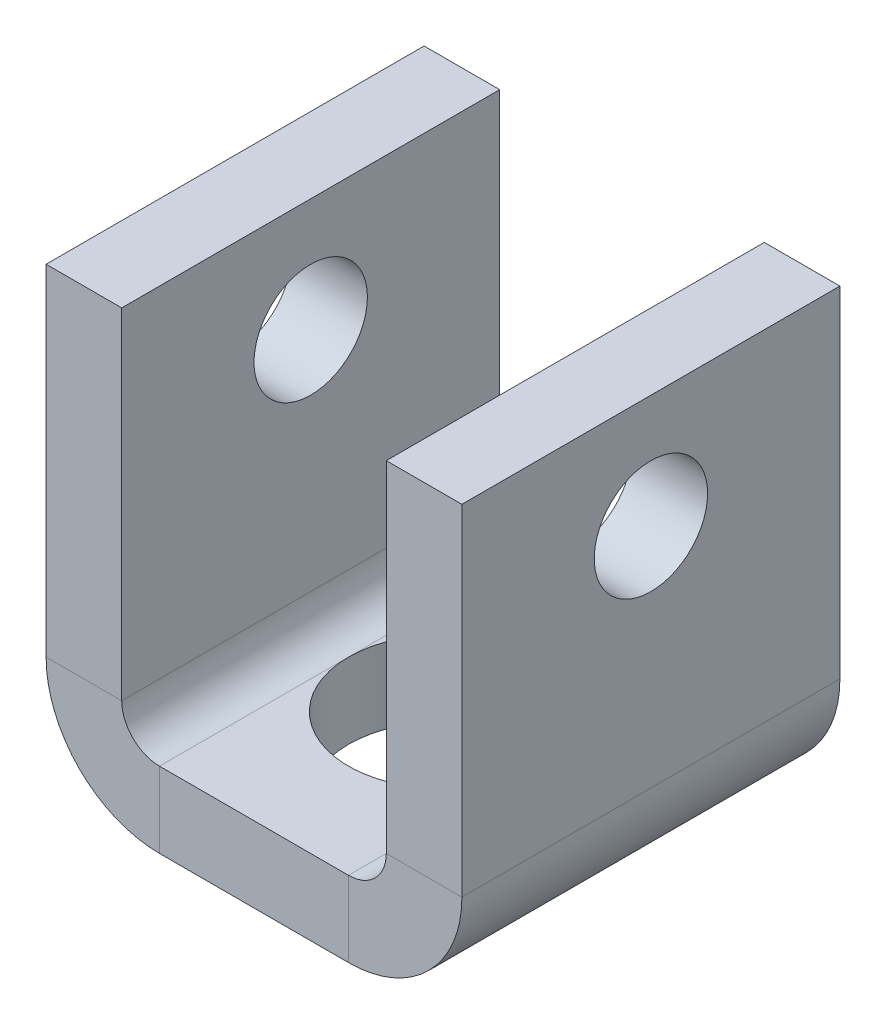
ISO-10303-21;
HEADER;
FILE_DESCRIPTION(('STEP AP214'),'2;1');
FILE_NAME('part.step','',(''),(''),'','','');
FILE_SCHEMA(('AUTOMOTIVE_DESIGN { 1 0 10303 214 1 1 1 1 }'));
ENDSEC;
DATA;
#1=APPLICATION_CONTEXT('core data for automotive mechanical design processes');
#2=APPLICATION_PROTOCOL_DEFINITION('international standard','automotive_design',2000,#1);
#3=PRODUCT_CONTEXT('',#1,'mechanical');
#4=PRODUCT('Part','Part','',(#3));
#5=PRODUCT_RELATED_PRODUCT_CATEGORY('part','',(#4));
#6=PRODUCT_DEFINITION_FORMATION('','',#4);
#7=PRODUCT_DEFINITION_CONTEXT('part definition',#1,'design');
#8=PRODUCT_DEFINITION('design','',#6,#7);
#9=PRODUCT_DEFINITION_SHAPE('','',#8);
#10=(LENGTH_UNIT() NAMED_UNIT(*) SI_UNIT(.MILLI.,.METRE.));
#11=(NAMED_UNIT(*) PLANE_ANGLE_UNIT() SI_UNIT($,.RADIAN.));
#12=(NAMED_UNIT(*) SI_UNIT($,.STERADIAN.) SOLID_ANGLE_UNIT());
#13=UNCERTAINTY_MEASURE_WITH_UNIT(LENGTH_MEASURE(1.E-05),#10,'distance_accuracy_value','');
#14=(GEOMETRIC_REPRESENTATION_CONTEXT(3) GLOBAL_UNCERTAINTY_ASSIGNED_CONTEXT((#13)) GLOBAL_UNIT_ASSIGNED_CONTEXT((#10,
#11,#12)) REPRESENTATION_CONTEXT('',''));
#15=CARTESIAN_POINT('',(0.,0.,0.));
#16=DIRECTION('',(0.,0.,1.));
#17=DIRECTION('',(1.,0.,0.));
#18=AXIS2_PLACEMENT_3D('',#15,#16,#17);
#19=CARTESIAN_POINT('',(-45.2821772639692,22.8679913294798,10.));
#20=DIRECTION('',(0.,1.,0.));
#21=DIRECTION('',(0.,0.,1.));
#22=AXIS2_PLACEMENT_3D('',#19,#20,#21);
#23=PLANE('',#22);
#24=DIRECTION('',(0.,0.,1.));
#25=VECTOR('',#24,1.);
#26=CARTESIAN_POINT('',(-42.2821772639692,22.8679913294798,0.));
#27=LINE('',#26,#25);
#28=CARTESIAN_POINT('',(-42.2821772639692,22.8679913294798,0.));
#29=VERTEX_POINT('',#28);
#30=CARTESIAN_POINT('',(-42.2821772639692,22.8679913294798,5.));
#31=VERTEX_POINT('',#30);
#32=EDGE_CURVE('E153',#29,#31,#27,.T.);
#33=ORIENTED_EDGE('',*,*,#32,.T.);
#34=CARTESIAN_POINT('',(-39.7821772639692,22.8679913294798,5.));
#35=DIRECTION('',(0.,1.,0.));
#36=DIRECTION('',(0.,0.,1.));
#37=AXIS2_PLACEMENT_3D('',#34,#35,#36);
#38=CIRCLE('',#37,2.5);
#39=CARTESIAN_POINT('',(-37.2821772639692,22.8679913294798,5.));
#40=VERTEX_POINT('',#39);
#41=EDGE_CURVE('E62',#31,#40,#38,.F.);
#42=ORIENTED_EDGE('',*,*,#41,.T.);
#43=DIRECTION('',(0.,0.,-1.));
#44=VECTOR('',#43,1.);
#45=CARTESIAN_POINT('',(-37.2821772639692,22.8679913294798,10.));
#46=LINE('',#45,#44);
#47=CARTESIAN_POINT('',(-37.2821772639692,22.8679913294798,0.));
#48=VERTEX_POINT('',#47);
#49=EDGE_CURVE('E150',#40,#48,#46,.T.);
#50=ORIENTED_EDGE('',*,*,#49,.T.);
#51=DIRECTION('',(1.,0.,0.));
#52=VECTOR('',#51,1.);
#53=CARTESIAN_POINT('',(-45.2821772639692,22.8679913294798,0.));
#54=LINE('',#53,#52);
#55=EDGE_CURVE('E305',#29,#48,#54,.T.);
#56=ORIENTED_EDGE('',*,*,#55,.F.);
#57=EDGE_LOOP('',(#33,#42,#50,#56));
#58=FACE_BOUND('',#57,.T.);
#59=ADVANCED_FACE('F39',(#58),#23,.T.);
#60=CARTESIAN_POINT('',(-37.2821772639692,22.8679913294798,10.));
#61=VERTEX_POINT('',#60);
#62=EDGE_CURVE('E162',#61,#40,#46,.T.);
#63=ORIENTED_EDGE('',*,*,#62,.T.);
#64=CARTESIAN_POINT('',(-39.7821772639692,22.8679913294798,5.));
#65=DIRECTION('',(0.,1.,0.));
#66=DIRECTION('',(0.,0.,1.));
#67=AXIS2_PLACEMENT_3D('',#64,#65,#66);
#68=CIRCLE('',#67,2.5);
#69=EDGE_CURVE('E139',#40,#31,#68,.F.);
#70=ORIENTED_EDGE('',*,*,#69,.T.);
#71=CARTESIAN_POINT('',(-42.2821772639692,22.8679913294798,10.));
#72=VERTEX_POINT('',#71);
#73=EDGE_CURVE('E308',#31,#72,#27,.T.);
#74=ORIENTED_EDGE('',*,*,#73,.T.);
#75=DIRECTION('',(1.,0.,0.));
#76=VECTOR('',#75,1.);
#77=CARTESIAN_POINT('',(-45.2821772639692,22.8679913294798,10.));
#78=LINE('',#77,#76);
#79=EDGE_CURVE('E172',#72,#61,#78,.T.);
#80=ORIENTED_EDGE('',*,*,#79,.T.);
#81=EDGE_LOOP('',(#63,#70,#74,#80));
#82=FACE_BOUND('',#81,.T.);
#83=ADVANCED_FACE('F170',(#82),#23,.T.);
#84=CARTESIAN_POINT('',(-45.2821772639692,20.8679913294798,10.));
#85=DIRECTION('',(0.,1.,0.));
#86=DIRECTION('',(0.,0.,1.));
#87=AXIS2_PLACEMENT_3D('',#84,#85,#86);
#88=PLANE('',#87);
#89=CARTESIAN_POINT('',(-39.7821772639692,20.8679913294798,5.));
#90=DIRECTION('',(0.,1.,0.));
#91=DIRECTION('',(0.,0.,1.));
#92=AXIS2_PLACEMENT_3D('',#89,#90,#91);
#93=CIRCLE('',#92,2.5);
#94=CARTESIAN_POINT('',(-42.2821772639692,20.8679913294798,5.));
#95=VERTEX_POINT('',#94);
#96=CARTESIAN_POINT('',(-37.2821772639692,20.8679913294798,5.));
#97=VERTEX_POINT('',#96);
#98=EDGE_CURVE('E55',#95,#97,#93,.F.);
#99=ORIENTED_EDGE('',*,*,#98,.F.);
#100=DIRECTION('',(0.,0.,1.));
#101=VECTOR('',#100,1.);
#102=CARTESIAN_POINT('',(-42.2821772639692,20.8679913294798,0.));
#103=LINE('',#102,#101);
#104=CARTESIAN_POINT('',(-42.2821772639692,20.8679913294798,0.));
#105=VERTEX_POINT('',#104);
#106=EDGE_CURVE('E303',#105,#95,#103,.T.);
#107=ORIENTED_EDGE('',*,*,#106,.F.);
#108=DIRECTION('',(1.,0.,0.));
#109=VECTOR('',#108,1.);
#110=CARTESIAN_POINT('',(-45.2821772639692,20.8679913294798,0.));
#111=LINE('',#110,#109);
#112=CARTESIAN_POINT('',(-37.2821772639692,20.8679913294798,0.));
#113=VERTEX_POINT('',#112);
#114=EDGE_CURVE('E293',#105,#113,#111,.T.);
#115=ORIENTED_EDGE('',*,*,#114,.T.);
#116=DIRECTION('',(0.,0.,-1.));
#117=VECTOR('',#116,1.);
#118=CARTESIAN_POINT('',(-37.2821772639692,20.8679913294798,10.));
#119=LINE('',#118,#117);
#120=EDGE_CURVE('E173',#97,#113,#119,.T.);
#121=ORIENTED_EDGE('',*,*,#120,.F.);
#122=EDGE_LOOP('',(#99,#107,#115,#121));
#123=FACE_BOUND('',#122,.T.);
#124=ADVANCED_FACE('F328',(#123),#88,.F.);
#125=EDGE_CURVE('E155',#97,#95,#93,.F.);
#126=ORIENTED_EDGE('',*,*,#125,.F.);
#127=CARTESIAN_POINT('',(-37.2821772639692,20.8679913294798,10.));
#128=VERTEX_POINT('',#127);
#129=EDGE_CURVE('E174',#128,#97,#119,.T.);
#130=ORIENTED_EDGE('',*,*,#129,.F.);
#131=DIRECTION('',(1.,0.,0.));
#132=VECTOR('',#131,1.);
#133=CARTESIAN_POINT('',(-45.2821772639692,20.8679913294798,10.));
#134=LINE('',#133,#132);
#135=CARTESIAN_POINT('',(-42.2821772639692,20.8679913294798,10.));
#136=VERTEX_POINT('',#135);
#137=EDGE_CURVE('E298',#136,#128,#134,.T.);
#138=ORIENTED_EDGE('',*,*,#137,.F.);
#139=EDGE_CURVE('E302',#95,#136,#103,.T.);
#140=ORIENTED_EDGE('',*,*,#139,.F.);
#141=EDGE_LOOP('',(#126,#130,#138,#140));
#142=FACE_BOUND('',#141,.T.);
#143=ADVANCED_FACE('F324',(#142),#88,.F.);
#144=CARTESIAN_POINT('',(-16.3749291698218,32.8679913294798,10.));
#145=DIRECTION('',(0.,1.,0.));
#146=DIRECTION('',(-1.,0.,0.));
#147=AXIS2_PLACEMENT_3D('',#144,#145,#146);
#148=PLANE('',#147);
#149=DIRECTION('',(0.,0.,-1.));
#150=VECTOR('',#149,1.);
#151=CARTESIAN_POINT('',(-45.2821772639692,32.8679913294798,10.));
#152=LINE('',#151,#150);
#153=CARTESIAN_POINT('',(-45.2821772639692,32.8679913294798,10.));
#154=VERTEX_POINT('',#153);
#155=CARTESIAN_POINT('',(-45.2821772639692,32.8679913294798,0.));
#156=VERTEX_POINT('',#155);
#157=EDGE_CURVE('E219',#154,#156,#152,.T.);
#158=ORIENTED_EDGE('',*,*,#157,.F.);
#159=DIRECTION('',(-1.,0.,0.));
#160=VECTOR('',#159,1.);
#161=CARTESIAN_POINT('',(-16.3749291698218,32.8679913294798,10.));
#162=LINE('',#161,#160);
#163=CARTESIAN_POINT('',(-43.2821772639692,32.8679913294798,10.));
#164=VERTEX_POINT('',#163);
#165=EDGE_CURVE('E216',#164,#154,#162,.T.);
#166=ORIENTED_EDGE('',*,*,#165,.F.);
#167=DIRECTION('',(0.,0.,-1.));
#168=VECTOR('',#167,1.);
#169=CARTESIAN_POINT('',(-43.2821772639692,32.8679913294798,10.));
#170=LINE('',#169,#168);
#171=CARTESIAN_POINT('',(-43.2821772639692,32.8679913294798,0.));
#172=VERTEX_POINT('',#171);
#173=EDGE_CURVE('E237',#164,#172,#170,.T.);
#174=ORIENTED_EDGE('',*,*,#173,.T.);
#175=DIRECTION('',(-1.,0.,0.));
#176=VECTOR('',#175,1.);
#177=CARTESIAN_POINT('',(-16.3749291698218,32.8679913294798,0.));
#178=LINE('',#177,#176);
#179=EDGE_CURVE('E234',#172,#156,#178,.T.);
#180=ORIENTED_EDGE('',*,*,#179,.T.);
#181=EDGE_LOOP('',(#158,#166,#174,#180));
#182=FACE_BOUND('',#181,.T.);
#183=ADVANCED_FACE('F266',(#182),#148,.T.);
#184=CARTESIAN_POINT('',(-16.3749291698218,32.8679913294798,0.));
#185=DIRECTION('',(0.,0.,-1.));
#186=DIRECTION('',(0.,1.,0.));
#187=AXIS2_PLACEMENT_3D('',#184,#185,#186);
#188=PLANE('',#187);
#189=DIRECTION('',(0.,-1.,0.));
#190=VECTOR('',#189,1.);
#191=CARTESIAN_POINT('',(-45.2821772639692,32.8679913294798,0.));
#192=LINE('',#191,#190);
#193=CARTESIAN_POINT('',(-45.2821772639692,23.8679913294798,0.));
#194=VERTEX_POINT('',#193);
#195=EDGE_CURVE('E224',#156,#194,#192,.T.);
#196=ORIENTED_EDGE('',*,*,#195,.F.);
#197=ORIENTED_EDGE('',*,*,#179,.F.);
#198=DIRECTION('',(0.,1.,0.));
#199=VECTOR('',#198,1.);
#200=CARTESIAN_POINT('',(-43.2821772639692,32.8679913294798,0.));
#201=LINE('',#200,#199);
#202=CARTESIAN_POINT('',(-43.2821772639692,23.8679913294798,0.));
#203=VERTEX_POINT('',#202);
#204=EDGE_CURVE('E231',#172,#203,#201,.F.);
#205=ORIENTED_EDGE('',*,*,#204,.T.);
#206=DIRECTION('',(-1.,0.,0.));
#207=VECTOR('',#206,1.);
#208=CARTESIAN_POINT('',(-16.3749291698218,23.8679913294798,0.));
#209=LINE('',#208,#207);
#210=EDGE_CURVE('E228',#203,#194,#209,.T.);
#211=ORIENTED_EDGE('',*,*,#210,.T.);
#212=EDGE_LOOP('',(#196,#197,#205,#211));
#213=FACE_BOUND('',#212,.T.);
#214=ADVANCED_FACE('F269',(#213),#188,.T.);
#215=CARTESIAN_POINT('',(-45.2821772639692,32.8679913294798,10.));
#216=DIRECTION('',(1.,0.,0.));
#217=DIRECTION('',(0.,0.,-1.));
#218=AXIS2_PLACEMENT_3D('',#215,#216,#217);
#219=PLANE('',#218);
#220=CARTESIAN_POINT('',(-45.2821772639692,29.8679913294798,5.));
#221=DIRECTION('',(1.,0.,0.));
#222=DIRECTION('',(0.,0.,-1.));
#223=AXIS2_PLACEMENT_3D('',#220,#221,#222);
#224=CIRCLE('',#223,1.5);
#225=CARTESIAN_POINT('',(-45.2821772639692,29.8679913294798,3.5));
#226=VERTEX_POINT('',#225);
#227=EDGE_CURVE('E389',#226,#226,#224,.F.);
#228=ORIENTED_EDGE('',*,*,#227,.F.);
#229=EDGE_LOOP('',(#228));
#230=FACE_BOUND('',#229,.T.);
#231=ORIENTED_EDGE('',*,*,#195,.T.);
#232=DIRECTION('',(0.,0.,1.));
#233=VECTOR('',#232,1.);
#234=CARTESIAN_POINT('',(-45.2821772639692,23.8679913294798,0.));
#235=LINE('',#234,#233);
#236=CARTESIAN_POINT('',(-45.2821772639692,23.8679913294798,10.));
#237=VERTEX_POINT('',#236);
#238=EDGE_CURVE('E221',#194,#237,#235,.T.);
#239=ORIENTED_EDGE('',*,*,#238,.T.);
#240=DIRECTION('',(0.,-1.,0.));
#241=VECTOR('',#240,1.);
#242=CARTESIAN_POINT('',(-45.2821772639692,32.8679913294798,10.));
#243=LINE('',#242,#241);
#244=EDGE_CURVE('E48',#154,#237,#243,.T.);
#245=ORIENTED_EDGE('',*,*,#244,.F.);
#246=ORIENTED_EDGE('',*,*,#157,.T.);
#247=EDGE_LOOP('',(#231,#239,#245,#246));
#248=FACE_BOUND('',#247,.T.);
#249=ADVANCED_FACE('F271',(#230,#248),#219,.F.);
#250=CARTESIAN_POINT('',(-16.3749291698218,32.8679913294798,10.));
#251=DIRECTION('',(0.,0.,-1.));
#252=DIRECTION('',(0.,1.,0.));
#253=AXIS2_PLACEMENT_3D('',#250,#251,#252);
#254=PLANE('',#253);
#255=ORIENTED_EDGE('',*,*,#165,.T.);
#256=ORIENTED_EDGE('',*,*,#244,.T.);
#257=DIRECTION('',(-1.,0.,0.));
#258=VECTOR('',#257,1.);
#259=CARTESIAN_POINT('',(-16.3749291698218,23.8679913294798,10.));
#260=LINE('',#259,#258);
#261=CARTESIAN_POINT('',(-43.2821772639692,23.8679913294798,10.));
#262=VERTEX_POINT('',#261);
#263=EDGE_CURVE('E239',#262,#237,#260,.T.);
#264=ORIENTED_EDGE('',*,*,#263,.F.);
#265=DIRECTION('',(0.,1.,0.));
#266=VECTOR('',#265,1.);
#267=CARTESIAN_POINT('',(-43.2821772639692,32.8679913294798,10.));
#268=LINE('',#267,#266);
#269=EDGE_CURVE('E11',#164,#262,#268,.F.);
#270=ORIENTED_EDGE('',*,*,#269,.F.);
#271=EDGE_LOOP('',(#255,#256,#264,#270));
#272=FACE_BOUND('',#271,.T.);
#273=ADVANCED_FACE('F260',(#272),#254,.F.);
#274=CARTESIAN_POINT('',(-43.2821772639692,32.8679913294798,10.));
#275=DIRECTION('',(1.,0.,0.));
#276=DIRECTION('',(0.,0.,-1.));
#277=AXIS2_PLACEMENT_3D('',#274,#275,#276);
#278=PLANE('',#277);
#279=CARTESIAN_POINT('',(-43.2821772639692,29.8679913294798,5.));
#280=DIRECTION('',(1.,0.,0.));
#281=DIRECTION('',(0.,0.,-1.));
#282=AXIS2_PLACEMENT_3D('',#279,#280,#281);
#283=CIRCLE('',#282,1.5);
#284=CARTESIAN_POINT('',(-43.2821772639692,29.8679913294798,3.5));
#285=VERTEX_POINT('',#284);
#286=EDGE_CURVE('E397',#285,#285,#283,.T.);
#287=ORIENTED_EDGE('',*,*,#286,.F.);
#288=EDGE_LOOP('',(#287));
#289=FACE_BOUND('',#288,.T.);
#290=DIRECTION('',(0.,0.,1.));
#291=VECTOR('',#290,1.);
#292=CARTESIAN_POINT('',(-43.2821772639692,23.8679913294798,0.));
#293=LINE('',#292,#291);
#294=EDGE_CURVE('E183',#203,#262,#293,.T.);
#295=ORIENTED_EDGE('',*,*,#294,.F.);
#296=ORIENTED_EDGE('',*,*,#204,.F.);
#297=ORIENTED_EDGE('',*,*,#173,.F.);
#298=ORIENTED_EDGE('',*,*,#269,.T.);
#299=EDGE_LOOP('',(#295,#296,#297,#298));
#300=FACE_BOUND('',#299,.T.);
#301=ADVANCED_FACE('F41',(#289,#300),#278,.T.);
#302=CARTESIAN_POINT('',(-63.1894253581166,32.8679913294798,10.));
#303=DIRECTION('',(0.,-1.,0.));
#304=DIRECTION('',(1.,0.,0.));
#305=AXIS2_PLACEMENT_3D('',#302,#303,#304);
#306=PLANE('',#305);
#307=DIRECTION('',(1.,0.,0.));
#308=VECTOR('',#307,1.);
#309=CARTESIAN_POINT('',(-63.1894253581166,32.8679913294798,10.));
#310=LINE('',#309,#308);
#311=CARTESIAN_POINT('',(-36.2821772639692,32.8679913294798,10.));
#312=VERTEX_POINT('',#311);
#313=CARTESIAN_POINT('',(-34.2821772639692,32.8679913294798,10.));
#314=VERTEX_POINT('',#313);
#315=EDGE_CURVE('E206',#312,#314,#310,.T.);
#316=ORIENTED_EDGE('',*,*,#315,.T.);
#317=DIRECTION('',(0.,0.,-1.));
#318=VECTOR('',#317,1.);
#319=CARTESIAN_POINT('',(-34.2821772639692,32.8679913294798,10.));
#320=LINE('',#319,#318);
#321=CARTESIAN_POINT('',(-34.2821772639692,32.8679913294798,0.));
#322=VERTEX_POINT('',#321);
#323=EDGE_CURVE('E202',#314,#322,#320,.T.);
#324=ORIENTED_EDGE('',*,*,#323,.T.);
#325=DIRECTION('',(1.,0.,0.));
#326=VECTOR('',#325,1.);
#327=CARTESIAN_POINT('',(-63.1894253581166,32.8679913294798,0.));
#328=LINE('',#327,#326);
#329=CARTESIAN_POINT('',(-36.2821772639692,32.8679913294798,0.));
#330=VERTEX_POINT('',#329);
#331=EDGE_CURVE('E186',#330,#322,#328,.T.);
#332=ORIENTED_EDGE('',*,*,#331,.F.);
#333=DIRECTION('',(0.,0.,-1.));
#334=VECTOR('',#333,1.);
#335=CARTESIAN_POINT('',(-36.2821772639692,32.8679913294798,10.));
#336=LINE('',#335,#334);
#337=EDGE_CURVE('E181',#312,#330,#336,.T.);
#338=ORIENTED_EDGE('',*,*,#337,.F.);
#339=EDGE_LOOP('',(#316,#324,#332,#338));
#340=FACE_BOUND('',#339,.T.);
#341=ADVANCED_FACE('F345',(#340),#306,.F.);
#342=CARTESIAN_POINT('',(-63.1894253581166,20.8679913294798,10.));
#343=DIRECTION('',(0.,0.,-1.));
#344=DIRECTION('',(0.,-1.,0.));
#345=AXIS2_PLACEMENT_3D('',#342,#343,#344);
#346=PLANE('',#345);
#347=DIRECTION('',(1.,0.,0.));
#348=VECTOR('',#347,1.);
#349=CARTESIAN_POINT('',(-63.1894253581166,23.8679913294798,10.));
#350=LINE('',#349,#348);
#351=CARTESIAN_POINT('',(-36.2821772639692,23.8679913294798,10.));
#352=VERTEX_POINT('',#351);
#353=CARTESIAN_POINT('',(-34.2821772639692,23.8679913294798,10.));
#354=VERTEX_POINT('',#353);
#355=EDGE_CURVE('E199',#352,#354,#350,.T.);
#356=ORIENTED_EDGE('',*,*,#355,.T.);
#357=DIRECTION('',(0.,1.,0.));
#358=VECTOR('',#357,1.);
#359=CARTESIAN_POINT('',(-34.2821772639692,20.8679913294798,10.));
#360=LINE('',#359,#358);
#361=EDGE_CURVE('E197',#354,#314,#360,.T.);
#362=ORIENTED_EDGE('',*,*,#361,.T.);
#363=ORIENTED_EDGE('',*,*,#315,.F.);
#364=DIRECTION('',(0.,1.,0.));
#365=VECTOR('',#364,1.);
#366=CARTESIAN_POINT('',(-36.2821772639692,20.8679913294798,10.));
#367=LINE('',#366,#365);
#368=EDGE_CURVE('E184',#352,#312,#367,.T.);
#369=ORIENTED_EDGE('',*,*,#368,.F.);
#370=EDGE_LOOP('',(#356,#362,#363,#369));
#371=FACE_BOUND('',#370,.T.);
#372=ADVANCED_FACE('F349',(#371),#346,.F.);
#373=CARTESIAN_POINT('',(-34.2821772639692,20.8679913294798,10.));
#374=DIRECTION('',(-1.,0.,0.));
#375=DIRECTION('',(0.,0.,1.));
#376=AXIS2_PLACEMENT_3D('',#373,#374,#375);
#377=PLANE('',#376);
#378=CARTESIAN_POINT('',(-34.2821772639692,29.8679913294798,5.));
#379=DIRECTION('',(1.,0.,0.));
#380=DIRECTION('',(0.,0.,-1.));
#381=AXIS2_PLACEMENT_3D('',#378,#379,#380);
#382=CIRCLE('',#381,1.5);
#383=CARTESIAN_POINT('',(-34.2821772639692,29.8679913294798,3.5));
#384=VERTEX_POINT('',#383);
#385=EDGE_CURVE('E386',#384,#384,#382,.T.);
#386=ORIENTED_EDGE('',*,*,#385,.F.);
#387=EDGE_LOOP('',(#386));
#388=FACE_BOUND('',#387,.T.);
#389=ORIENTED_EDGE('',*,*,#361,.F.);
#390=DIRECTION('',(0.,0.,-1.));
#391=VECTOR('',#390,1.);
#392=CARTESIAN_POINT('',(-34.2821772639692,23.8679913294798,10.));
#393=LINE('',#392,#391);
#394=CARTESIAN_POINT('',(-34.2821772639692,23.8679913294798,0.));
#395=VERTEX_POINT('',#394);
#396=EDGE_CURVE('E194',#354,#395,#393,.T.);
#397=ORIENTED_EDGE('',*,*,#396,.T.);
#398=DIRECTION('',(0.,1.,0.));
#399=VECTOR('',#398,1.);
#400=CARTESIAN_POINT('',(-34.2821772639692,20.8679913294798,0.));
#401=LINE('',#400,#399);
#402=EDGE_CURVE('E191',#395,#322,#401,.T.);
#403=ORIENTED_EDGE('',*,*,#402,.T.);
#404=ORIENTED_EDGE('',*,*,#323,.F.);
#405=EDGE_LOOP('',(#389,#397,#403,#404));
#406=FACE_BOUND('',#405,.T.);
#407=ADVANCED_FACE('F339',(#388,#406),#377,.F.);
#408=CARTESIAN_POINT('',(-63.1894253581166,20.8679913294798,0.));
#409=DIRECTION('',(0.,0.,-1.));
#410=DIRECTION('',(0.,-1.,0.));
#411=AXIS2_PLACEMENT_3D('',#408,#409,#410);
#412=PLANE('',#411);
#413=ORIENTED_EDGE('',*,*,#402,.F.);
#414=DIRECTION('',(1.,0.,0.));
#415=VECTOR('',#414,1.);
#416=CARTESIAN_POINT('',(-63.1894253581166,23.8679913294798,0.));
#417=LINE('',#416,#415);
#418=CARTESIAN_POINT('',(-36.2821772639692,23.8679913294798,0.));
#419=VERTEX_POINT('',#418);
#420=EDGE_CURVE('E210',#419,#395,#417,.T.);
#421=ORIENTED_EDGE('',*,*,#420,.F.);
#422=DIRECTION('',(0.,1.,0.));
#423=VECTOR('',#422,1.);
#424=CARTESIAN_POINT('',(-36.2821772639692,20.8679913294798,0.));
#425=LINE('',#424,#423);
#426=EDGE_CURVE('E188',#419,#330,#425,.T.);
#427=ORIENTED_EDGE('',*,*,#426,.T.);
#428=ORIENTED_EDGE('',*,*,#331,.T.);
#429=EDGE_LOOP('',(#413,#421,#427,#428));
#430=FACE_BOUND('',#429,.T.);
#431=ADVANCED_FACE('F341',(#430),#412,.T.);
#432=CARTESIAN_POINT('',(-36.2821772639692,20.8679913294798,10.));
#433=DIRECTION('',(-1.,0.,0.));
#434=DIRECTION('',(0.,0.,1.));
#435=AXIS2_PLACEMENT_3D('',#432,#433,#434);
#436=PLANE('',#435);
#437=CARTESIAN_POINT('',(-36.2821772639692,29.8679913294798,5.));
#438=DIRECTION('',(-1.,0.,0.));
#439=DIRECTION('',(0.,0.,1.));
#440=AXIS2_PLACEMENT_3D('',#437,#438,#439);
#441=CIRCLE('',#440,1.5);
#442=CARTESIAN_POINT('',(-36.2821772639692,29.8679913294798,6.5));
#443=VERTEX_POINT('',#442);
#444=EDGE_CURVE('E43',#443,#443,#441,.T.);
#445=ORIENTED_EDGE('',*,*,#444,.F.);
#446=EDGE_LOOP('',(#445));
#447=FACE_BOUND('',#446,.T.);
#448=DIRECTION('',(0.,0.,-1.));
#449=VECTOR('',#448,1.);
#450=CARTESIAN_POINT('',(-36.2821772639692,23.8679913294798,10.));
#451=LINE('',#450,#449);
#452=EDGE_CURVE('E180',#352,#419,#451,.T.);
#453=ORIENTED_EDGE('',*,*,#452,.F.);
#454=ORIENTED_EDGE('',*,*,#368,.T.);
#455=ORIENTED_EDGE('',*,*,#337,.T.);
#456=ORIENTED_EDGE('',*,*,#426,.F.);
#457=EDGE_LOOP('',(#453,#454,#455,#456));
#458=FACE_BOUND('',#457,.T.);
#459=ADVANCED_FACE('F352',(#447,#458),#436,.T.);
#460=CARTESIAN_POINT('',(-45.2821772639692,45.2286711044777,0.));
#461=DIRECTION('',(0.,0.,-1.));
#462=DIRECTION('',(-1.,0.,0.));
#463=AXIS2_PLACEMENT_3D('',#460,#461,#462);
#464=PLANE('',#463);
#465=ORIENTED_EDGE('',*,*,#114,.F.);
#466=DIRECTION('',(0.,-1.,0.));
#467=VECTOR('',#466,1.);
#468=CARTESIAN_POINT('',(-42.2821772639692,45.2286711044777,0.));
#469=LINE('',#468,#467);
#470=EDGE_CURVE('E167',#29,#105,#469,.T.);
#471=ORIENTED_EDGE('',*,*,#470,.F.);
#472=ORIENTED_EDGE('',*,*,#55,.T.);
#473=DIRECTION('',(0.,-1.,0.));
#474=VECTOR('',#473,1.);
#475=CARTESIAN_POINT('',(-37.2821772639692,45.2286711044777,0.));
#476=LINE('',#475,#474);
#477=EDGE_CURVE('E310',#48,#113,#476,.T.);
#478=ORIENTED_EDGE('',*,*,#477,.T.);
#479=EDGE_LOOP('',(#465,#471,#472,#478));
#480=FACE_BOUND('',#479,.T.);
#481=ADVANCED_FACE('F354',(#480),#464,.T.);
#482=CARTESIAN_POINT('',(-45.2821772639692,45.2286711044777,10.));
#483=DIRECTION('',(0.,0.,-1.));
#484=DIRECTION('',(-1.,0.,0.));
#485=AXIS2_PLACEMENT_3D('',#482,#483,#484);
#486=PLANE('',#485);
#487=DIRECTION('',(0.,-1.,0.));
#488=VECTOR('',#487,1.);
#489=CARTESIAN_POINT('',(-42.2821772639692,45.2286711044777,10.));
#490=LINE('',#489,#488);
#491=EDGE_CURVE('E256',#72,#136,#490,.T.);
#492=ORIENTED_EDGE('',*,*,#491,.T.);
#493=ORIENTED_EDGE('',*,*,#137,.T.);
#494=DIRECTION('',(0.,-1.,0.));
#495=VECTOR('',#494,1.);
#496=CARTESIAN_POINT('',(-37.2821772639692,45.2286711044777,10.));
#497=LINE('',#496,#495);
#498=EDGE_CURVE('E313',#61,#128,#497,.T.);
#499=ORIENTED_EDGE('',*,*,#498,.F.);
#500=ORIENTED_EDGE('',*,*,#79,.F.);
#501=EDGE_LOOP('',(#492,#493,#499,#500));
#502=FACE_BOUND('',#501,.T.);
#503=ADVANCED_FACE('F315',(#502),#486,.F.);
#504=CARTESIAN_POINT('',(-37.2821772639692,23.8679913294798,0.));
#505=DIRECTION('',(0.,0.,-1.));
#506=DIRECTION('',(-1.,0.,0.));
#507=AXIS2_PLACEMENT_3D('',#504,#505,#506);
#508=PLANE('',#507);
#509=ORIENTED_EDGE('',*,*,#477,.F.);
#510=CARTESIAN_POINT('',(-37.2821772639692,23.8679913294798,0.));
#511=DIRECTION('',(0.,0.,-1.));
#512=DIRECTION('',(-1.,0.,0.));
#513=AXIS2_PLACEMENT_3D('',#510,#511,#512);
#514=CIRCLE('',#513,0.999999999999998);
#515=EDGE_CURVE('E165',#48,#419,#514,.F.);
#516=ORIENTED_EDGE('',*,*,#515,.T.);
#517=ORIENTED_EDGE('',*,*,#420,.T.);
#518=CARTESIAN_POINT('',(-37.2821772639692,23.8679913294798,0.));
#519=DIRECTION('',(0.,0.,-1.));
#520=DIRECTION('',(-1.,0.,0.));
#521=AXIS2_PLACEMENT_3D('',#518,#519,#520);
#522=CIRCLE('',#521,3.);
#523=EDGE_CURVE('E291',#113,#395,#522,.F.);
#524=ORIENTED_EDGE('',*,*,#523,.F.);
#525=EDGE_LOOP('',(#509,#516,#517,#524));
#526=FACE_BOUND('',#525,.T.);
#527=ADVANCED_FACE('F332',(#526),#508,.T.);
#528=CARTESIAN_POINT('',(-37.2821772639692,23.8679913294798,10.));
#529=DIRECTION('',(0.,0.,1.));
#530=DIRECTION('',(1.,0.,0.));
#531=AXIS2_PLACEMENT_3D('',#528,#529,#530);
#532=PLANE('',#531);
#533=ORIENTED_EDGE('',*,*,#355,.F.);
#534=CARTESIAN_POINT('',(-37.2821772639692,23.8679913294798,10.));
#535=DIRECTION('',(0.,0.,-1.));
#536=DIRECTION('',(-1.,0.,0.));
#537=AXIS2_PLACEMENT_3D('',#534,#535,#536);
#538=CIRCLE('',#537,0.999999999999998);
#539=EDGE_CURVE('E283',#352,#61,#538,.T.);
#540=ORIENTED_EDGE('',*,*,#539,.T.);
#541=ORIENTED_EDGE('',*,*,#498,.T.);
#542=CARTESIAN_POINT('',(-37.2821772639692,23.8679913294798,10.));
#543=DIRECTION('',(0.,0.,-1.));
#544=DIRECTION('',(-1.,0.,0.));
#545=AXIS2_PLACEMENT_3D('',#542,#543,#544);
#546=CIRCLE('',#545,3.);
#547=EDGE_CURVE('E288',#354,#128,#546,.T.);
#548=ORIENTED_EDGE('',*,*,#547,.F.);
#549=EDGE_LOOP('',(#533,#540,#541,#548));
#550=FACE_BOUND('',#549,.T.);
#551=ADVANCED_FACE('F319',(#550),#532,.T.);
#552=CARTESIAN_POINT('',(-37.2821772639692,23.8679913294798,41.0081431519951));
#553=DIRECTION('',(0.,0.,-1.));
#554=DIRECTION('',(-1.,0.,0.));
#555=AXIS2_PLACEMENT_3D('',#552,#553,#554);
#556=CYLINDRICAL_SURFACE('',#555,3.);
#557=ORIENTED_EDGE('',*,*,#547,.T.);
#558=ORIENTED_EDGE('',*,*,#129,.T.);
#559=ORIENTED_EDGE('',*,*,#120,.T.);
#560=ORIENTED_EDGE('',*,*,#523,.T.);
#561=ORIENTED_EDGE('',*,*,#396,.F.);
#562=EDGE_LOOP('',(#557,#558,#559,#560,#561));
#563=FACE_BOUND('',#562,.T.);
#564=ADVANCED_FACE('F322',(#563),#556,.T.);
#565=CARTESIAN_POINT('',(-37.2821772639692,23.8679913294798,41.0081431519951));
#566=DIRECTION('',(0.,0.,-1.));
#567=DIRECTION('',(-1.,0.,0.));
#568=AXIS2_PLACEMENT_3D('',#565,#566,#567);
#569=CYLINDRICAL_SURFACE('',#568,0.999999999999998);
#570=ORIENTED_EDGE('',*,*,#539,.F.);
#571=ORIENTED_EDGE('',*,*,#452,.T.);
#572=ORIENTED_EDGE('',*,*,#515,.F.);
#573=ORIENTED_EDGE('',*,*,#49,.F.);
#574=ORIENTED_EDGE('',*,*,#62,.F.);
#575=EDGE_LOOP('',(#570,#571,#572,#573,#574));
#576=FACE_BOUND('',#575,.T.);
#577=ADVANCED_FACE('F161',(#576),#569,.F.);
#578=CARTESIAN_POINT('',(-42.2821772639692,23.8679913294798,10.));
#579=DIRECTION('',(0.,0.,1.));
#580=DIRECTION('',(1.,0.,0.));
#581=AXIS2_PLACEMENT_3D('',#578,#579,#580);
#582=PLANE('',#581);
#583=ORIENTED_EDGE('',*,*,#491,.F.);
#584=CARTESIAN_POINT('',(-42.2821772639692,23.8679913294798,10.));
#585=DIRECTION('',(0.,0.,1.));
#586=DIRECTION('',(1.,0.,0.));
#587=AXIS2_PLACEMENT_3D('',#584,#585,#586);
#588=CIRCLE('',#587,1.);
#589=EDGE_CURVE('E247',#72,#262,#588,.F.);
#590=ORIENTED_EDGE('',*,*,#589,.T.);
#591=ORIENTED_EDGE('',*,*,#263,.T.);
#592=CARTESIAN_POINT('',(-42.2821772639692,23.8679913294798,10.));
#593=DIRECTION('',(0.,0.,1.));
#594=DIRECTION('',(1.,0.,0.));
#595=AXIS2_PLACEMENT_3D('',#592,#593,#594);
#596=CIRCLE('',#595,3.);
#597=EDGE_CURVE('E278',#136,#237,#596,.F.);
#598=ORIENTED_EDGE('',*,*,#597,.F.);
#599=EDGE_LOOP('',(#583,#590,#591,#598));
#600=FACE_BOUND('',#599,.T.);
#601=ADVANCED_FACE('F253',(#600),#582,.T.);
#602=CARTESIAN_POINT('',(-42.2821772639692,23.8679913294798,0.));
#603=DIRECTION('',(0.,0.,-1.));
#604=DIRECTION('',(-1.,0.,0.));
#605=AXIS2_PLACEMENT_3D('',#602,#603,#604);
#606=PLANE('',#605);
#607=ORIENTED_EDGE('',*,*,#210,.F.);
#608=CARTESIAN_POINT('',(-42.2821772639692,23.8679913294798,0.));
#609=DIRECTION('',(0.,0.,1.));
#610=DIRECTION('',(1.,0.,0.));
#611=AXIS2_PLACEMENT_3D('',#608,#609,#610);
#612=CIRCLE('',#611,1.);
#613=EDGE_CURVE('E144',#203,#29,#612,.T.);
#614=ORIENTED_EDGE('',*,*,#613,.T.);
#615=ORIENTED_EDGE('',*,*,#470,.T.);
#616=CARTESIAN_POINT('',(-42.2821772639692,23.8679913294798,0.));
#617=DIRECTION('',(0.,0.,1.));
#618=DIRECTION('',(1.,0.,0.));
#619=AXIS2_PLACEMENT_3D('',#616,#617,#618);
#620=CIRCLE('',#619,3.);
#621=EDGE_CURVE('E257',#194,#105,#620,.T.);
#622=ORIENTED_EDGE('',*,*,#621,.F.);
#623=EDGE_LOOP('',(#607,#614,#615,#622));
#624=FACE_BOUND('',#623,.T.);
#625=ADVANCED_FACE('F280',(#624),#606,.T.);
#626=CARTESIAN_POINT('',(-42.2821772639692,23.8679913294798,-25.488894731297));
#627=DIRECTION('',(0.,0.,1.));
#628=DIRECTION('',(1.,0.,0.));
#629=AXIS2_PLACEMENT_3D('',#626,#627,#628);
#630=CYLINDRICAL_SURFACE('',#629,3.);
#631=ORIENTED_EDGE('',*,*,#621,.T.);
#632=ORIENTED_EDGE('',*,*,#106,.T.);
#633=ORIENTED_EDGE('',*,*,#139,.T.);
#634=ORIENTED_EDGE('',*,*,#597,.T.);
#635=ORIENTED_EDGE('',*,*,#238,.F.);
#636=EDGE_LOOP('',(#631,#632,#633,#634,#635));
#637=FACE_BOUND('',#636,.T.);
#638=ADVANCED_FACE('F275',(#637),#630,.T.);
#639=CARTESIAN_POINT('',(-42.2821772639692,23.8679913294798,-25.488894731297));
#640=DIRECTION('',(0.,0.,1.));
#641=DIRECTION('',(1.,0.,0.));
#642=AXIS2_PLACEMENT_3D('',#639,#640,#641);
#643=CYLINDRICAL_SURFACE('',#642,1.);
#644=ORIENTED_EDGE('',*,*,#613,.F.);
#645=ORIENTED_EDGE('',*,*,#294,.T.);
#646=ORIENTED_EDGE('',*,*,#589,.F.);
#647=ORIENTED_EDGE('',*,*,#73,.F.);
#648=ORIENTED_EDGE('',*,*,#32,.F.);
#649=EDGE_LOOP('',(#644,#645,#646,#647,#648));
#650=FACE_BOUND('',#649,.T.);
#651=ADVANCED_FACE('F246',(#650),#643,.F.);
#652=CARTESIAN_POINT('',(-39.7821772639692,20.8679913294798,5.));
#653=DIRECTION('',(0.,1.,0.));
#654=DIRECTION('',(0.,0.,1.));
#655=AXIS2_PLACEMENT_3D('',#652,#653,#654);
#656=CYLINDRICAL_SURFACE('',#655,2.5);
#657=ORIENTED_EDGE('',*,*,#69,.F.);
#658=ORIENTED_EDGE('',*,*,#41,.F.);
#659=EDGE_LOOP('',(#657,#658));
#660=FACE_BOUND('',#659,.T.);
#661=ORIENTED_EDGE('',*,*,#98,.T.);
#662=ORIENTED_EDGE('',*,*,#125,.T.);
#663=EDGE_LOOP('',(#661,#662));
#664=FACE_BOUND('',#663,.T.);
#665=ADVANCED_FACE('F140',(#660,#664),#656,.F.);
#666=CARTESIAN_POINT('',(-49.5248179510885,29.8679913294798,5.));
#667=DIRECTION('',(1.,0.,0.));
#668=DIRECTION('',(0.,0.,-1.));
#669=AXIS2_PLACEMENT_3D('',#666,#667,#668);
#670=CYLINDRICAL_SURFACE('',#669,1.5);
#671=ORIENTED_EDGE('',*,*,#444,.T.);
#672=EDGE_LOOP('',(#671));
#673=FACE_BOUND('',#672,.T.);
#674=ORIENTED_EDGE('',*,*,#385,.T.);
#675=EDGE_LOOP('',(#674));
#676=FACE_BOUND('',#675,.T.);
#677=ADVANCED_FACE('F405',(#673,#676),#670,.F.);
#678=ORIENTED_EDGE('',*,*,#286,.T.);
#679=EDGE_LOOP('',(#678));
#680=FACE_BOUND('',#679,.T.);
#681=ORIENTED_EDGE('',*,*,#227,.T.);
#682=EDGE_LOOP('',(#681));
#683=FACE_BOUND('',#682,.T.);
#684=ADVANCED_FACE('F407',(#680,#683),#670,.F.);
#685=CLOSED_SHELL('',(#59,#83,#124,#143,#183,#214,#249,#273,#301,#341,#372,#407,#431,#459,#481,
#503,#527,#551,#564,#577,#601,#625,#638,#651,#665,#677,#684));
#686=MANIFOLD_SOLID_BREP('B2',#685);
#687=ADVANCED_BREP_SHAPE_REPRESENTATION('',(#18,#686),#14);
#688=SHAPE_DEFINITION_REPRESENTATION(#9,#687);
ENDSEC;
END-ISO-10303-21;
